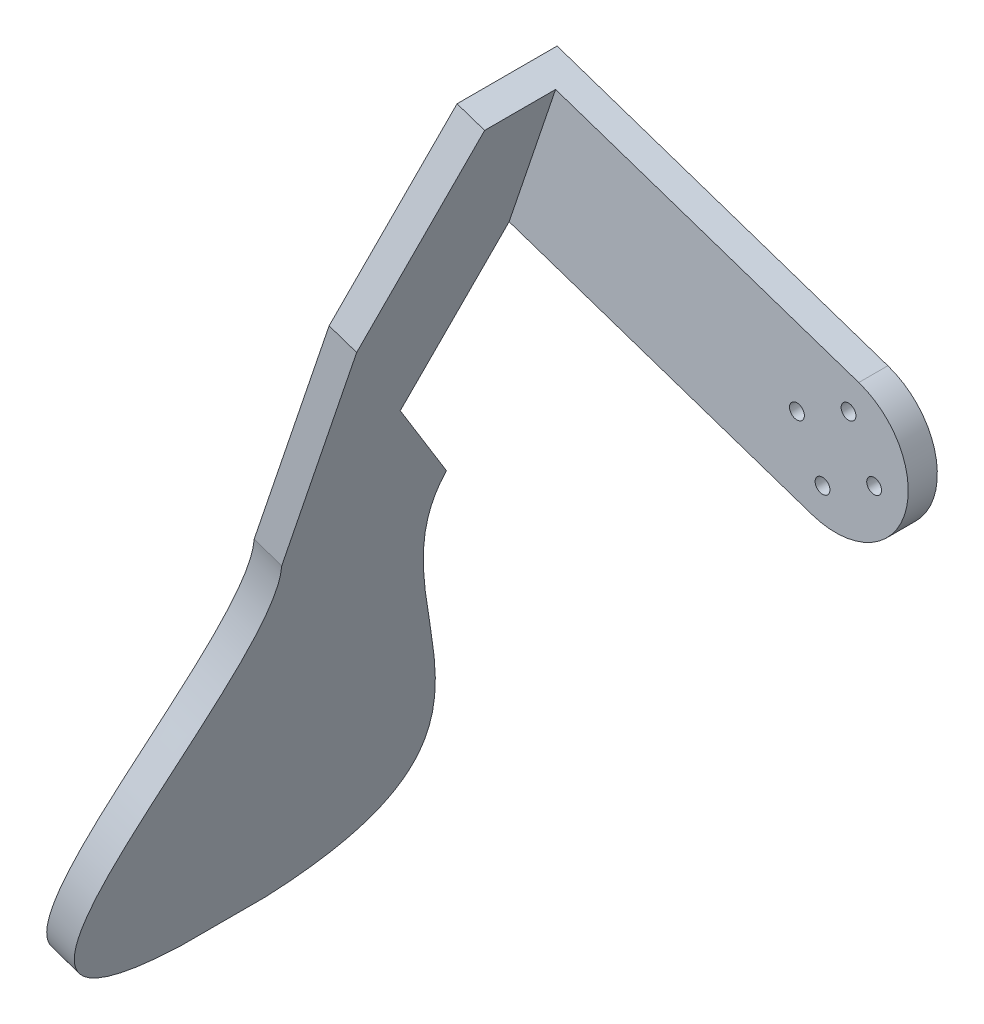
ISO-10303-21;
HEADER;
FILE_DESCRIPTION(('STEP AP214'),'2;1');
FILE_NAME('part.step','',(''),(''),'','','');
FILE_SCHEMA(('AUTOMOTIVE_DESIGN { 1 0 10303 214 1 1 1 1 }'));
ENDSEC;
DATA;
#1=APPLICATION_CONTEXT('core data for automotive mechanical design processes');
#2=APPLICATION_PROTOCOL_DEFINITION('international standard','automotive_design',2000,#1);
#3=PRODUCT_CONTEXT('',#1,'mechanical');
#4=PRODUCT('Part','Part','',(#3));
#5=PRODUCT_RELATED_PRODUCT_CATEGORY('part','',(#4));
#6=PRODUCT_DEFINITION_FORMATION('','',#4);
#7=PRODUCT_DEFINITION_CONTEXT('part definition',#1,'design');
#8=PRODUCT_DEFINITION('design','',#6,#7);
#9=PRODUCT_DEFINITION_SHAPE('','',#8);
#10=(LENGTH_UNIT() NAMED_UNIT(*) SI_UNIT(.MILLI.,.METRE.));
#11=(NAMED_UNIT(*) PLANE_ANGLE_UNIT() SI_UNIT($,.RADIAN.));
#12=(NAMED_UNIT(*) SI_UNIT($,.STERADIAN.) SOLID_ANGLE_UNIT());
#13=UNCERTAINTY_MEASURE_WITH_UNIT(LENGTH_MEASURE(1.E-05),#10,'distance_accuracy_value','');
#14=(GEOMETRIC_REPRESENTATION_CONTEXT(3) GLOBAL_UNCERTAINTY_ASSIGNED_CONTEXT((#13)) GLOBAL_UNIT_ASSIGNED_CONTEXT((#10,
#11,#12)) REPRESENTATION_CONTEXT('',''));
#15=CARTESIAN_POINT('',(0.,0.,0.));
#16=DIRECTION('',(0.,0.,1.));
#17=DIRECTION('',(1.,0.,0.));
#18=AXIS2_PLACEMENT_3D('',#15,#16,#17);
#19=CARTESIAN_POINT('',(0.,0.,3.));
#20=DIRECTION('',(0.,0.,1.));
#21=DIRECTION('',(1.,0.,0.));
#22=AXIS2_PLACEMENT_3D('',#19,#20,#21);
#23=PLANE('',#22);
#24=DIRECTION('',(-0.319540588884544,-0.947572589333038,0.));
#25=VECTOR('',#24,1.);
#26=CARTESIAN_POINT('',(-48.1222350522603,29.4193897553129,3.));
#27=LINE('',#26,#25);
#28=CARTESIAN_POINT('',(-48.1222350522604,29.4193897553129,3.));
#29=VERTEX_POINT('',#28);
#30=CARTESIAN_POINT('',(-56.110749774374,5.73007502198693,3.));
#31=VERTEX_POINT('',#30);
#32=EDGE_CURVE('E49',#29,#31,#27,.T.);
#33=ORIENTED_EDGE('',*,*,#32,.T.);
#34=DIRECTION('',(0.947572589333038,-0.319540588884544,0.));
#35=VECTOR('',#34,1.);
#36=CARTESIAN_POINT('',(-3.99425736105682,-11.844657366663,3.));
#37=LINE('',#36,#35);
#38=CARTESIAN_POINT('',(-3.99425736105682,-11.844657366663,3.));
#39=VERTEX_POINT('',#38);
#40=EDGE_CURVE('E249',#31,#39,#37,.T.);
#41=ORIENTED_EDGE('',*,*,#40,.T.);
#42=CARTESIAN_POINT('',(0.,0.,3.));
#43=DIRECTION('',(0.,0.,1.));
#44=DIRECTION('',(1.,0.,0.));
#45=AXIS2_PLACEMENT_3D('',#42,#43,#44);
#46=CIRCLE('',#45,12.5);
#47=CARTESIAN_POINT('',(3.99425736105677,11.844657366663,3.));
#48=VERTEX_POINT('',#47);
#49=EDGE_CURVE('E226',#39,#48,#46,.T.);
#50=ORIENTED_EDGE('',*,*,#49,.T.);
#51=DIRECTION('',(-0.947572589333038,0.319540588884544,0.));
#52=VECTOR('',#51,1.);
#53=CARTESIAN_POINT('',(3.99425736105677,11.844657366663,3.));
#54=LINE('',#53,#52);
#55=EDGE_CURVE('E54',#48,#29,#54,.T.);
#56=ORIENTED_EDGE('',*,*,#55,.T.);
#57=EDGE_LOOP('',(#33,#41,#50,#56));
#58=FACE_BOUND('',#57,.T.);
#59=CARTESIAN_POINT('',(2.23678412219178,6.63300812533127,3.));
#60=DIRECTION('',(0.,0.,1.));
#61=DIRECTION('',(-1.,0.,0.));
#62=AXIS2_PLACEMENT_3D('',#59,#60,#61);
#63=CIRCLE('',#62,1.275);
#64=CARTESIAN_POINT('',(0.961784122191787,6.63300812533127,3.));
#65=VERTEX_POINT('',#64);
#66=EDGE_CURVE('E262',#65,#65,#63,.T.);
#67=ORIENTED_EDGE('',*,*,#66,.F.);
#68=EDGE_LOOP('',(#67));
#69=FACE_BOUND('',#68,.T.);
#70=CARTESIAN_POINT('',(6.63300812533124,-2.23678412219181,3.));
#71=DIRECTION('',(0.,0.,1.));
#72=DIRECTION('',(1.,0.,0.));
#73=AXIS2_PLACEMENT_3D('',#70,#71,#72);
#74=CIRCLE('',#73,1.27499999999999);
#75=CARTESIAN_POINT('',(7.90800812533123,-2.23678412219181,3.));
#76=VERTEX_POINT('',#75);
#77=EDGE_CURVE('E11',#76,#76,#74,.T.);
#78=ORIENTED_EDGE('',*,*,#77,.F.);
#79=EDGE_LOOP('',(#78));
#80=FACE_BOUND('',#79,.T.);
#81=CARTESIAN_POINT('',(-6.63300812533129,2.23678412219181,3.));
#82=DIRECTION('',(0.,0.,1.));
#83=DIRECTION('',(-1.,0.,0.));
#84=AXIS2_PLACEMENT_3D('',#81,#82,#83);
#85=CIRCLE('',#84,1.275);
#86=CARTESIAN_POINT('',(-7.90800812533129,2.23678412219181,3.));
#87=VERTEX_POINT('',#86);
#88=EDGE_CURVE('E42',#87,#87,#85,.T.);
#89=ORIENTED_EDGE('',*,*,#88,.F.);
#90=EDGE_LOOP('',(#89));
#91=FACE_BOUND('',#90,.T.);
#92=CARTESIAN_POINT('',(-2.23678412219184,-6.63300812533127,3.));
#93=DIRECTION('',(0.,0.,1.));
#94=DIRECTION('',(1.,0.,0.));
#95=AXIS2_PLACEMENT_3D('',#92,#93,#94);
#96=CIRCLE('',#95,1.275);
#97=CARTESIAN_POINT('',(-0.961784122191841,-6.63300812533127,3.));
#98=VERTEX_POINT('',#97);
#99=EDGE_CURVE('E255',#98,#98,#96,.T.);
#100=ORIENTED_EDGE('',*,*,#99,.F.);
#101=EDGE_LOOP('',(#100));
#102=FACE_BOUND('',#101,.T.);
#103=ADVANCED_FACE('F35',(#58,#69,#80,#91,#102),#23,.T.);
#104=CARTESIAN_POINT('',(6.63300812533124,-2.23678412219181,3.));
#105=DIRECTION('',(0.,0.,-1.));
#106=DIRECTION('',(-1.,0.,0.));
#107=AXIS2_PLACEMENT_3D('',#104,#105,#106);
#108=CYLINDRICAL_SURFACE('',#107,1.27499999999999);
#109=ORIENTED_EDGE('',*,*,#77,.T.);
#110=EDGE_LOOP('',(#109));
#111=FACE_BOUND('',#110,.T.);
#112=CARTESIAN_POINT('',(6.63300812533124,-2.23678412219181,-2.));
#113=DIRECTION('',(0.,0.,1.));
#114=DIRECTION('',(1.,0.,0.));
#115=AXIS2_PLACEMENT_3D('',#112,#113,#114);
#116=CIRCLE('',#115,1.275);
#117=CARTESIAN_POINT('',(7.90800812533124,-2.23678412219181,-2.));
#118=VERTEX_POINT('',#117);
#119=EDGE_CURVE('E224',#118,#118,#116,.T.);
#120=ORIENTED_EDGE('',*,*,#119,.F.);
#121=EDGE_LOOP('',(#120));
#122=FACE_BOUND('',#121,.T.);
#123=ADVANCED_FACE('F213',(#111,#122),#108,.F.);
#124=CARTESIAN_POINT('',(-6.63300812533129,2.23678412219181,3.));
#125=DIRECTION('',(0.,0.,-1.));
#126=DIRECTION('',(-1.,0.,0.));
#127=AXIS2_PLACEMENT_3D('',#124,#125,#126);
#128=CYLINDRICAL_SURFACE('',#127,1.275);
#129=ORIENTED_EDGE('',*,*,#88,.T.);
#130=EDGE_LOOP('',(#129));
#131=FACE_BOUND('',#130,.T.);
#132=CARTESIAN_POINT('',(-6.63300812533129,2.23678412219181,-2.));
#133=DIRECTION('',(0.,0.,1.));
#134=DIRECTION('',(-1.,0.,0.));
#135=AXIS2_PLACEMENT_3D('',#132,#133,#134);
#136=CIRCLE('',#135,1.275);
#137=CARTESIAN_POINT('',(-7.90800812533129,2.23678412219181,-2.));
#138=VERTEX_POINT('',#137);
#139=EDGE_CURVE('E227',#138,#138,#136,.T.);
#140=ORIENTED_EDGE('',*,*,#139,.F.);
#141=EDGE_LOOP('',(#140));
#142=FACE_BOUND('',#141,.T.);
#143=ADVANCED_FACE('F210',(#131,#142),#128,.F.);
#144=CARTESIAN_POINT('',(2.23678412219178,6.63300812533127,3.));
#145=DIRECTION('',(0.,0.,-1.));
#146=DIRECTION('',(-1.,0.,0.));
#147=AXIS2_PLACEMENT_3D('',#144,#145,#146);
#148=CYLINDRICAL_SURFACE('',#147,1.275);
#149=ORIENTED_EDGE('',*,*,#66,.T.);
#150=EDGE_LOOP('',(#149));
#151=FACE_BOUND('',#150,.T.);
#152=CARTESIAN_POINT('',(2.23678412219178,6.63300812533127,-2.));
#153=DIRECTION('',(0.,0.,1.));
#154=DIRECTION('',(-1.,0.,0.));
#155=AXIS2_PLACEMENT_3D('',#152,#153,#154);
#156=CIRCLE('',#155,1.275);
#157=CARTESIAN_POINT('',(0.961784122191779,6.63300812533127,-2.));
#158=VERTEX_POINT('',#157);
#159=EDGE_CURVE('E231',#158,#158,#156,.T.);
#160=ORIENTED_EDGE('',*,*,#159,.F.);
#161=EDGE_LOOP('',(#160));
#162=FACE_BOUND('',#161,.T.);
#163=ADVANCED_FACE('F206',(#151,#162),#148,.F.);
#164=CARTESIAN_POINT('',(-2.23678412219184,-6.63300812533127,3.));
#165=DIRECTION('',(0.,0.,-1.));
#166=DIRECTION('',(-1.,0.,0.));
#167=AXIS2_PLACEMENT_3D('',#164,#165,#166);
#168=CYLINDRICAL_SURFACE('',#167,1.275);
#169=ORIENTED_EDGE('',*,*,#99,.T.);
#170=EDGE_LOOP('',(#169));
#171=FACE_BOUND('',#170,.T.);
#172=CARTESIAN_POINT('',(-2.23678412219184,-6.63300812533127,-2.));
#173=DIRECTION('',(0.,0.,1.));
#174=DIRECTION('',(1.,0.,0.));
#175=AXIS2_PLACEMENT_3D('',#172,#173,#174);
#176=CIRCLE('',#175,1.275);
#177=CARTESIAN_POINT('',(-0.961784122191837,-6.63300812533127,-2.));
#178=VERTEX_POINT('',#177);
#179=EDGE_CURVE('E273',#178,#178,#176,.T.);
#180=ORIENTED_EDGE('',*,*,#179,.F.);
#181=EDGE_LOOP('',(#180));
#182=FACE_BOUND('',#181,.T.);
#183=ADVANCED_FACE('F202',(#171,#182),#168,.F.);
#184=CARTESIAN_POINT('',(0.,0.,-2.));
#185=DIRECTION('',(0.,0.,1.));
#186=DIRECTION('',(1.,0.,0.));
#187=AXIS2_PLACEMENT_3D('',#184,#185,#186);
#188=CYLINDRICAL_SURFACE('',#187,12.5);
#189=ORIENTED_EDGE('',*,*,#49,.F.);
#190=DIRECTION('',(0.,0.,1.));
#191=VECTOR('',#190,1.);
#192=CARTESIAN_POINT('',(-3.99425736105682,-11.844657366663,-2.));
#193=LINE('',#192,#191);
#194=CARTESIAN_POINT('',(-3.99425736105682,-11.844657366663,-2.));
#195=VERTEX_POINT('',#194);
#196=EDGE_CURVE('E252',#195,#39,#193,.T.);
#197=ORIENTED_EDGE('',*,*,#196,.F.);
#198=CARTESIAN_POINT('',(0.,0.,-2.));
#199=DIRECTION('',(0.,0.,1.));
#200=DIRECTION('',(1.,0.,0.));
#201=AXIS2_PLACEMENT_3D('',#198,#199,#200);
#202=CIRCLE('',#201,12.5);
#203=CARTESIAN_POINT('',(3.99425736105677,11.844657366663,-2.));
#204=VERTEX_POINT('',#203);
#205=EDGE_CURVE('E235',#195,#204,#202,.T.);
#206=ORIENTED_EDGE('',*,*,#205,.T.);
#207=DIRECTION('',(0.,0.,1.));
#208=VECTOR('',#207,1.);
#209=CARTESIAN_POINT('',(3.99425736105677,11.844657366663,-2.));
#210=LINE('',#209,#208);
#211=EDGE_CURVE('E246',#204,#48,#210,.T.);
#212=ORIENTED_EDGE('',*,*,#211,.T.);
#213=EDGE_LOOP('',(#189,#197,#206,#212));
#214=FACE_BOUND('',#213,.T.);
#215=ADVANCED_FACE('F193',(#214),#188,.T.);
#216=CARTESIAN_POINT('',(-3.99425736105682,-11.844657366663,-2.));
#217=DIRECTION('',(-0.319540588884544,-0.947572589333038,0.));
#218=DIRECTION('',(0.947572589333038,-0.319540588884544,0.));
#219=AXIS2_PLACEMENT_3D('',#216,#217,#218);
#220=PLANE('',#219);
#221=CARTESIAN_POINT('',(-60.8486127210391,7.32777796640965,3.));
#222=VERTEX_POINT('',#221);
#223=EDGE_CURVE('E239',#222,#31,#37,.T.);
#224=ORIENTED_EDGE('',*,*,#223,.F.);
#225=DIRECTION('',(0.,0.,1.));
#226=VECTOR('',#225,1.);
#227=CARTESIAN_POINT('',(-60.8486127210391,7.32777796640965,-2.));
#228=LINE('',#227,#226);
#229=CARTESIAN_POINT('',(-60.8486127210391,7.32777796640965,-2.));
#230=VERTEX_POINT('',#229);
#231=EDGE_CURVE('E256',#230,#222,#228,.T.);
#232=ORIENTED_EDGE('',*,*,#231,.F.);
#233=DIRECTION('',(0.947572589333038,-0.319540588884544,0.));
#234=VECTOR('',#233,1.);
#235=CARTESIAN_POINT('',(-3.99425736105682,-11.844657366663,-2.));
#236=LINE('',#235,#234);
#237=EDGE_CURVE('E244',#230,#195,#236,.T.);
#238=ORIENTED_EDGE('',*,*,#237,.T.);
#239=ORIENTED_EDGE('',*,*,#196,.T.);
#240=ORIENTED_EDGE('',*,*,#40,.F.);
#241=EDGE_LOOP('',(#224,#232,#238,#239,#240));
#242=FACE_BOUND('',#241,.T.);
#243=ADVANCED_FACE('F189',(#242),#220,.T.);
#244=CARTESIAN_POINT('',(-60.8486127210391,7.32777796640965,-2.));
#245=DIRECTION('',(-0.947572589333038,0.319540588884544,0.));
#246=DIRECTION('',(-0.319540588884544,-0.947572589333038,0.));
#247=AXIS2_PLACEMENT_3D('',#244,#245,#246);
#248=PLANE('',#247);
#249=ORIENTED_EDGE('',*,*,#231,.T.);
#250=DIRECTION('',(-0.305501052956994,-0.905939445142053,0.29316007295994));
#251=VECTOR('',#250,1.);
#252=CARTESIAN_POINT('',(-60.8486127210391,7.32777796640966,3.));
#253=LINE('',#252,#251);
#254=CARTESIAN_POINT('',(-70.4016912961122,-21.0011283333616,12.1671736805919));
#255=VERTEX_POINT('',#254);
#256=EDGE_CURVE('E308',#222,#255,#253,.T.);
#257=ORIENTED_EDGE('',*,*,#256,.T.);
#258=DIRECTION('',(-0.260974755861519,-0.773900198486547,-0.577036099031512));
#259=VECTOR('',#258,1.);
#260=CARTESIAN_POINT('',(-76.9670797429082,-40.4702735590892,-2.34942630801388));
#261=LINE('',#260,#259);
#262=CARTESIAN_POINT('',(-76.9670797429082,-40.4702735590892,-2.34942630801388));
#263=VERTEX_POINT('',#262);
#264=EDGE_CURVE('E302',#255,#263,#261,.T.);
#265=ORIENTED_EDGE('',*,*,#264,.T.);
#266=CARTESIAN_POINT('',(-76.9670797429082,-40.4702735590892,-2.34942630801388));
#267=CARTESIAN_POINT('',(-84.8116895263892,-63.7328494677985,4.50924851770427));
#268=CARTESIAN_POINT('',(-100.184872051579,-109.320818190441,-45.4262710400087));
#269=CARTESIAN_POINT('',(-101.336989987171,-112.737333692452,4.31057369198615));
#270=B_SPLINE_CURVE_WITH_KNOTS('',3,(#266,#267,#268,#269),.UNSPECIFIED.,.F.,.F.,(4,4),(0.,1.),.UNSPECIFIED.);
#271=CARTESIAN_POINT('',(-101.336989987171,-112.737333692452,4.31057369198615));
#272=VERTEX_POINT('',#271);
#273=EDGE_CURVE('E297',#263,#272,#270,.T.);
#274=ORIENTED_EDGE('',*,*,#273,.T.);
#275=DIRECTION('',(0.,0.,1.));
#276=VECTOR('',#275,1.);
#277=CARTESIAN_POINT('',(-101.336989987171,-112.737333692452,4.31057369198615));
#278=LINE('',#277,#276);
#279=CARTESIAN_POINT('',(-101.336989987171,-112.737333692452,19.3105736919861));
#280=VERTEX_POINT('',#279);
#281=EDGE_CURVE('E291',#272,#280,#278,.T.);
#282=ORIENTED_EDGE('',*,*,#281,.T.);
#283=CARTESIAN_POINT('',(-101.336989987171,-112.737333692452,19.3105736919861));
#284=CARTESIAN_POINT('',(-100.184872051578,-109.320818190439,69.0474184239774));
#285=CARTESIAN_POINT('',(-84.8116895263894,-63.7328494677989,19.1118988662633));
#286=CARTESIAN_POINT('',(-76.9670797429082,-40.4702735590892,25.9705736919862));
#287=B_SPLINE_CURVE_WITH_KNOTS('',3,(#283,#284,#285,#286),.UNSPECIFIED.,.F.,.F.,(4,4),(0.,1.),.UNSPECIFIED.);
#288=CARTESIAN_POINT('',(-76.9670797429082,-40.4702735590892,25.9705736919862));
#289=VERTEX_POINT('',#288);
#290=EDGE_CURVE('E145',#280,#289,#287,.T.);
#291=ORIENTED_EDGE('',*,*,#290,.T.);
#292=DIRECTION('',(0.319540588884544,0.947572589333038,0.));
#293=VECTOR('',#292,1.);
#294=CARTESIAN_POINT('',(-76.9670797429082,-40.4702735590892,25.9705736919862));
#295=LINE('',#294,#293);
#296=CARTESIAN_POINT('',(-64.084814938249,-2.2689262434422,25.9705736919861));
#297=VERTEX_POINT('',#296);
#298=EDGE_CURVE('E142',#289,#297,#295,.T.);
#299=ORIENTED_EDGE('',*,*,#298,.T.);
#300=DIRECTION('',(0.305501052956994,0.905939445142053,-0.29316007295994));
#301=VECTOR('',#300,1.);
#302=CARTESIAN_POINT('',(-52.8600979989255,31.0170926997356,15.1992889286895));
#303=LINE('',#302,#301);
#304=CARTESIAN_POINT('',(-52.8600979989255,31.0170926997356,15.1992889286895));
#305=VERTEX_POINT('',#304);
#306=EDGE_CURVE('E311',#297,#305,#303,.T.);
#307=ORIENTED_EDGE('',*,*,#306,.T.);
#308=DIRECTION('',(0.,0.,1.));
#309=VECTOR('',#308,1.);
#310=CARTESIAN_POINT('',(-52.8600979989255,31.0170926997356,-2.));
#311=LINE('',#310,#309);
#312=CARTESIAN_POINT('',(-52.8600979989255,31.0170926997356,-2.));
#313=VERTEX_POINT('',#312);
#314=EDGE_CURVE('E124',#313,#305,#311,.T.);
#315=ORIENTED_EDGE('',*,*,#314,.F.);
#316=DIRECTION('',(-0.319540588884544,-0.947572589333038,0.));
#317=VECTOR('',#316,1.);
#318=CARTESIAN_POINT('',(-60.8486127210391,7.32777796640965,-2.));
#319=LINE('',#318,#317);
#320=EDGE_CURVE('E241',#313,#230,#319,.T.);
#321=ORIENTED_EDGE('',*,*,#320,.T.);
#322=EDGE_LOOP('',(#249,#257,#265,#274,#282,#291,#299,#307,#315,#321));
#323=FACE_BOUND('',#322,.T.);
#324=ADVANCED_FACE('F192',(#323),#248,.T.);
#325=CARTESIAN_POINT('',(3.99425736105677,11.844657366663,-2.));
#326=DIRECTION('',(0.319540588884544,0.947572589333038,0.));
#327=DIRECTION('',(-0.947572589333038,0.319540588884544,0.));
#328=AXIS2_PLACEMENT_3D('',#325,#326,#327);
#329=PLANE('',#328);
#330=ORIENTED_EDGE('',*,*,#55,.F.);
#331=ORIENTED_EDGE('',*,*,#211,.F.);
#332=DIRECTION('',(-0.947572589333038,0.319540588884544,0.));
#333=VECTOR('',#332,1.);
#334=CARTESIAN_POINT('',(3.99425736105677,11.844657366663,-2.));
#335=LINE('',#334,#333);
#336=EDGE_CURVE('E238',#204,#313,#335,.T.);
#337=ORIENTED_EDGE('',*,*,#336,.T.);
#338=ORIENTED_EDGE('',*,*,#314,.T.);
#339=DIRECTION('',(-0.947572589333038,0.319540588884544,0.));
#340=VECTOR('',#339,1.);
#341=CARTESIAN_POINT('',(-48.1222350522603,29.4193897553129,15.1992889286895));
#342=LINE('',#341,#340);
#343=CARTESIAN_POINT('',(-48.1222350522603,29.4193897553129,15.1992889286895));
#344=VERTEX_POINT('',#343);
#345=EDGE_CURVE('E119',#344,#305,#342,.T.);
#346=ORIENTED_EDGE('',*,*,#345,.F.);
#347=DIRECTION('',(0.,0.,-1.));
#348=VECTOR('',#347,1.);
#349=CARTESIAN_POINT('',(-48.1222350522603,29.4193897553129,3.));
#350=LINE('',#349,#348);
#351=EDGE_CURVE('E122',#344,#29,#350,.T.);
#352=ORIENTED_EDGE('',*,*,#351,.T.);
#353=EDGE_LOOP('',(#330,#331,#337,#338,#346,#352));
#354=FACE_BOUND('',#353,.T.);
#355=ADVANCED_FACE('F121',(#354),#329,.T.);
#356=CARTESIAN_POINT('',(0.,0.,-2.));
#357=DIRECTION('',(0.,0.,1.));
#358=DIRECTION('',(1.,0.,0.));
#359=AXIS2_PLACEMENT_3D('',#356,#357,#358);
#360=PLANE('',#359);
#361=ORIENTED_EDGE('',*,*,#179,.T.);
#362=EDGE_LOOP('',(#361));
#363=FACE_BOUND('',#362,.T.);
#364=ORIENTED_EDGE('',*,*,#159,.T.);
#365=EDGE_LOOP('',(#364));
#366=FACE_BOUND('',#365,.T.);
#367=ORIENTED_EDGE('',*,*,#139,.T.);
#368=EDGE_LOOP('',(#367));
#369=FACE_BOUND('',#368,.T.);
#370=ORIENTED_EDGE('',*,*,#119,.T.);
#371=EDGE_LOOP('',(#370));
#372=FACE_BOUND('',#371,.T.);
#373=ORIENTED_EDGE('',*,*,#205,.F.);
#374=ORIENTED_EDGE('',*,*,#237,.F.);
#375=ORIENTED_EDGE('',*,*,#320,.F.);
#376=ORIENTED_EDGE('',*,*,#336,.F.);
#377=EDGE_LOOP('',(#373,#374,#375,#376));
#378=FACE_BOUND('',#377,.T.);
#379=ADVANCED_FACE('F185',(#363,#366,#369,#372,#378),#360,.F.);
#380=CARTESIAN_POINT('',(-48.1222350522603,29.4193897553129,15.1992889286895));
#381=DIRECTION('',(0.0936765423510553,0.277790449423713,0.956063372178917));
#382=DIRECTION('',(0.,-0.960286052909562,0.27901737685559));
#383=AXIS2_PLACEMENT_3D('',#380,#381,#382);
#384=PLANE('',#383);
#385=ORIENTED_EDGE('',*,*,#306,.F.);
#386=DIRECTION('',(-0.947572589333038,0.319540588884544,0.));
#387=VECTOR('',#386,1.);
#388=CARTESIAN_POINT('',(-59.3469519915838,-3.86662918786492,25.9705736919861));
#389=LINE('',#388,#387);
#390=CARTESIAN_POINT('',(-59.3469519915838,-3.86662918786492,25.9705736919861));
#391=VERTEX_POINT('',#390);
#392=EDGE_CURVE('E141',#391,#297,#389,.T.);
#393=ORIENTED_EDGE('',*,*,#392,.F.);
#394=DIRECTION('',(0.305501052956994,0.905939445142053,-0.29316007295994));
#395=VECTOR('',#394,1.);
#396=CARTESIAN_POINT('',(-48.1222350522603,29.4193897553129,15.1992889286895));
#397=LINE('',#396,#395);
#398=EDGE_CURVE('E136',#391,#344,#397,.T.);
#399=ORIENTED_EDGE('',*,*,#398,.T.);
#400=ORIENTED_EDGE('',*,*,#345,.T.);
#401=EDGE_LOOP('',(#385,#393,#399,#400));
#402=FACE_BOUND('',#401,.T.);
#403=ADVANCED_FACE('F140',(#402),#384,.T.);
#404=CARTESIAN_POINT('',(-72.229216796243,-42.0679765035119,25.9705736919862));
#405=DIRECTION('',(0.,0.,1.));
#406=DIRECTION('',(0.,-1.,0.));
#407=AXIS2_PLACEMENT_3D('',#404,#405,#406);
#408=PLANE('',#407);
#409=ORIENTED_EDGE('',*,*,#298,.F.);
#410=DIRECTION('',(-0.947572589333038,0.319540588884544,0.));
#411=VECTOR('',#410,1.);
#412=CARTESIAN_POINT('',(-72.229216796243,-42.0679765035119,25.9705736919862));
#413=LINE('',#412,#411);
#414=CARTESIAN_POINT('',(-72.229216796243,-42.0679765035119,25.9705736919862));
#415=VERTEX_POINT('',#414);
#416=EDGE_CURVE('E276',#415,#289,#413,.T.);
#417=ORIENTED_EDGE('',*,*,#416,.F.);
#418=DIRECTION('',(0.319540588884544,0.947572589333038,0.));
#419=VECTOR('',#418,1.);
#420=CARTESIAN_POINT('',(-72.229216796243,-42.0679765035119,25.9705736919862));
#421=LINE('',#420,#419);
#422=EDGE_CURVE('E130',#415,#391,#421,.T.);
#423=ORIENTED_EDGE('',*,*,#422,.T.);
#424=ORIENTED_EDGE('',*,*,#392,.T.);
#425=EDGE_LOOP('',(#409,#417,#423,#424));
#426=FACE_BOUND('',#425,.T.);
#427=ADVANCED_FACE('F184',(#426),#408,.T.);
#428=CARTESIAN_POINT('',(-96.5991270405054,-114.335036636874,19.3105736919861));
#429=CARTESIAN_POINT('',(-95.4470091049128,-110.918521134861,69.0474184239774));
#430=CARTESIAN_POINT('',(-80.0738265797242,-65.3305524122216,19.1118988662633));
#431=CARTESIAN_POINT('',(-72.229216796243,-42.0679765035119,25.9705736919862));
#432=B_SPLINE_CURVE_WITH_KNOTS('',3,(#428,#429,#430,#431),.UNSPECIFIED.,.F.,.F.,(4,4),(0.,1.),.UNSPECIFIED.);
#433=DIRECTION('',(-0.947572589333038,0.319540588884544,0.));
#434=VECTOR('',#433,1.);
#435=SURFACE_OF_LINEAR_EXTRUSION('',#432,#434);
#436=ORIENTED_EDGE('',*,*,#290,.F.);
#437=DIRECTION('',(-0.947572589333038,0.319540588884544,0.));
#438=VECTOR('',#437,1.);
#439=CARTESIAN_POINT('',(-96.5991270405054,-114.335036636874,19.3105736919861));
#440=LINE('',#439,#438);
#441=CARTESIAN_POINT('',(-96.5991270405054,-114.335036636874,19.3105736919861));
#442=VERTEX_POINT('',#441);
#443=EDGE_CURVE('E284',#442,#280,#440,.T.);
#444=ORIENTED_EDGE('',*,*,#443,.F.);
#445=EDGE_CURVE('E313',#442,#415,#432,.T.);
#446=ORIENTED_EDGE('',*,*,#445,.T.);
#447=ORIENTED_EDGE('',*,*,#416,.T.);
#448=EDGE_LOOP('',(#436,#444,#446,#447));
#449=FACE_BOUND('',#448,.T.);
#450=ADVANCED_FACE('F321',(#449),#435,.T.);
#451=CARTESIAN_POINT('',(-96.5991270405054,-114.335036636874,4.31057369198615));
#452=DIRECTION('',(-0.319540588884544,-0.947572589333038,0.));
#453=DIRECTION('',(0.947572589333038,-0.319540588884544,0.));
#454=AXIS2_PLACEMENT_3D('',#451,#452,#453);
#455=PLANE('',#454);
#456=ORIENTED_EDGE('',*,*,#281,.F.);
#457=DIRECTION('',(-0.947572589333038,0.319540588884544,0.));
#458=VECTOR('',#457,1.);
#459=CARTESIAN_POINT('',(-96.5991270405054,-114.335036636874,4.31057369198615));
#460=LINE('',#459,#458);
#461=CARTESIAN_POINT('',(-96.5991270405054,-114.335036636874,4.31057369198615));
#462=VERTEX_POINT('',#461);
#463=EDGE_CURVE('E282',#462,#272,#460,.T.);
#464=ORIENTED_EDGE('',*,*,#463,.F.);
#465=DIRECTION('',(0.,0.,1.));
#466=VECTOR('',#465,1.);
#467=CARTESIAN_POINT('',(-96.5991270405054,-114.335036636874,4.31057369198615));
#468=LINE('',#467,#466);
#469=EDGE_CURVE('E161',#462,#442,#468,.T.);
#470=ORIENTED_EDGE('',*,*,#469,.T.);
#471=ORIENTED_EDGE('',*,*,#443,.T.);
#472=EDGE_LOOP('',(#456,#464,#470,#471));
#473=FACE_BOUND('',#472,.T.);
#474=ADVANCED_FACE('F172',(#473),#455,.T.);
#475=CARTESIAN_POINT('',(-72.229216796243,-42.0679765035119,-2.34942630801388));
#476=CARTESIAN_POINT('',(-80.073826579724,-65.3305524122212,4.50924851770427));
#477=CARTESIAN_POINT('',(-95.4470091049138,-110.918521134864,-45.4262710400087));
#478=CARTESIAN_POINT('',(-96.5991270405054,-114.335036636874,4.31057369198615));
#479=B_SPLINE_CURVE_WITH_KNOTS('',3,(#475,#476,#477,#478),.UNSPECIFIED.,.F.,.F.,(4,4),(0.,1.),.UNSPECIFIED.);
#480=DIRECTION('',(-0.947572589333038,0.319540588884544,0.));
#481=VECTOR('',#480,1.);
#482=SURFACE_OF_LINEAR_EXTRUSION('',#479,#481);
#483=ORIENTED_EDGE('',*,*,#273,.F.);
#484=DIRECTION('',(-0.947572589333038,0.319540588884544,0.));
#485=VECTOR('',#484,1.);
#486=CARTESIAN_POINT('',(-72.229216796243,-42.0679765035119,-2.34942630801388));
#487=LINE('',#486,#485);
#488=CARTESIAN_POINT('',(-72.229216796243,-42.0679765035119,-2.34942630801388));
#489=VERTEX_POINT('',#488);
#490=EDGE_CURVE('E280',#489,#263,#487,.T.);
#491=ORIENTED_EDGE('',*,*,#490,.F.);
#492=EDGE_CURVE('E155',#489,#462,#479,.T.);
#493=ORIENTED_EDGE('',*,*,#492,.T.);
#494=ORIENTED_EDGE('',*,*,#463,.T.);
#495=EDGE_LOOP('',(#483,#491,#493,#494));
#496=FACE_BOUND('',#495,.T.);
#497=ADVANCED_FACE('F167',(#496),#482,.T.);
#498=CARTESIAN_POINT('',(-72.229216796243,-42.0679765035119,-2.34942630801388));
#499=DIRECTION('',(0.184386454892169,0.546783590497925,-0.816718642137239));
#500=DIRECTION('',(0.,0.83096654245715,0.556322393326756));
#501=AXIS2_PLACEMENT_3D('',#498,#499,#500);
#502=PLANE('',#501);
#503=ORIENTED_EDGE('',*,*,#264,.F.);
#504=DIRECTION('',(-0.947572589333038,0.319540588884544,0.));
#505=VECTOR('',#504,1.);
#506=CARTESIAN_POINT('',(-65.663828349447,-22.5988312777843,12.1671736805919));
#507=LINE('',#506,#505);
#508=CARTESIAN_POINT('',(-65.663828349447,-22.5988312777843,12.1671736805919));
#509=VERTEX_POINT('',#508);
#510=EDGE_CURVE('E129',#509,#255,#507,.T.);
#511=ORIENTED_EDGE('',*,*,#510,.F.);
#512=DIRECTION('',(-0.260974755861519,-0.773900198486547,-0.577036099031512));
#513=VECTOR('',#512,1.);
#514=CARTESIAN_POINT('',(-72.229216796243,-42.0679765035119,-2.34942630801388));
#515=LINE('',#514,#513);
#516=EDGE_CURVE('E152',#509,#489,#515,.T.);
#517=ORIENTED_EDGE('',*,*,#516,.T.);
#518=ORIENTED_EDGE('',*,*,#490,.T.);
#519=EDGE_LOOP('',(#503,#511,#517,#518));
#520=FACE_BOUND('',#519,.T.);
#521=ADVANCED_FACE('F171',(#520),#502,.T.);
#522=CARTESIAN_POINT('',(-56.1107497743739,5.73007502198694,3.));
#523=DIRECTION('',(-0.0936765423510553,-0.277790449423713,-0.956063372178917));
#524=DIRECTION('',(0.,0.960286052909562,-0.27901737685559));
#525=AXIS2_PLACEMENT_3D('',#522,#523,#524);
#526=PLANE('',#525);
#527=ORIENTED_EDGE('',*,*,#256,.F.);
#528=ORIENTED_EDGE('',*,*,#223,.T.);
#529=DIRECTION('',(-0.305501052956994,-0.905939445142053,0.29316007295994));
#530=VECTOR('',#529,1.);
#531=CARTESIAN_POINT('',(-56.1107497743739,5.73007502198694,3.));
#532=LINE('',#531,#530);
#533=EDGE_CURVE('E149',#31,#509,#532,.T.);
#534=ORIENTED_EDGE('',*,*,#533,.T.);
#535=ORIENTED_EDGE('',*,*,#510,.T.);
#536=EDGE_LOOP('',(#527,#528,#534,#535));
#537=FACE_BOUND('',#536,.T.);
#538=ADVANCED_FACE('F177',(#537),#526,.T.);
#539=CARTESIAN_POINT('',(-86.9238563613324,-85.6437792227043,38.7198874068368));
#540=DIRECTION('',(0.947572589333038,-0.319540588884544,0.));
#541=DIRECTION('',(0.319540588884544,0.947572589333038,0.));
#542=AXIS2_PLACEMENT_3D('',#539,#540,#541);
#543=PLANE('',#542);
#544=ORIENTED_EDGE('',*,*,#398,.F.);
#545=ORIENTED_EDGE('',*,*,#422,.F.);
#546=ORIENTED_EDGE('',*,*,#445,.F.);
#547=ORIENTED_EDGE('',*,*,#469,.F.);
#548=ORIENTED_EDGE('',*,*,#492,.F.);
#549=ORIENTED_EDGE('',*,*,#516,.F.);
#550=ORIENTED_EDGE('',*,*,#533,.F.);
#551=ORIENTED_EDGE('',*,*,#32,.F.);
#552=ORIENTED_EDGE('',*,*,#351,.F.);
#553=EDGE_LOOP('',(#544,#545,#546,#547,#548,#549,#550,#551,#552));
#554=FACE_BOUND('',#553,.T.);
#555=ADVANCED_FACE('F134',(#554),#543,.T.);
#556=CLOSED_SHELL('',(#103,#123,#143,#163,#183,#215,#243,#324,#355,#379,#403,#427,#450,#474,
#497,#521,#538,#555));
#557=MANIFOLD_SOLID_BREP('B2',#556);
#558=ADVANCED_BREP_SHAPE_REPRESENTATION('',(#18,#557),#14);
#559=SHAPE_DEFINITION_REPRESENTATION(#9,#558);
ENDSEC;
END-ISO-10303-21;
